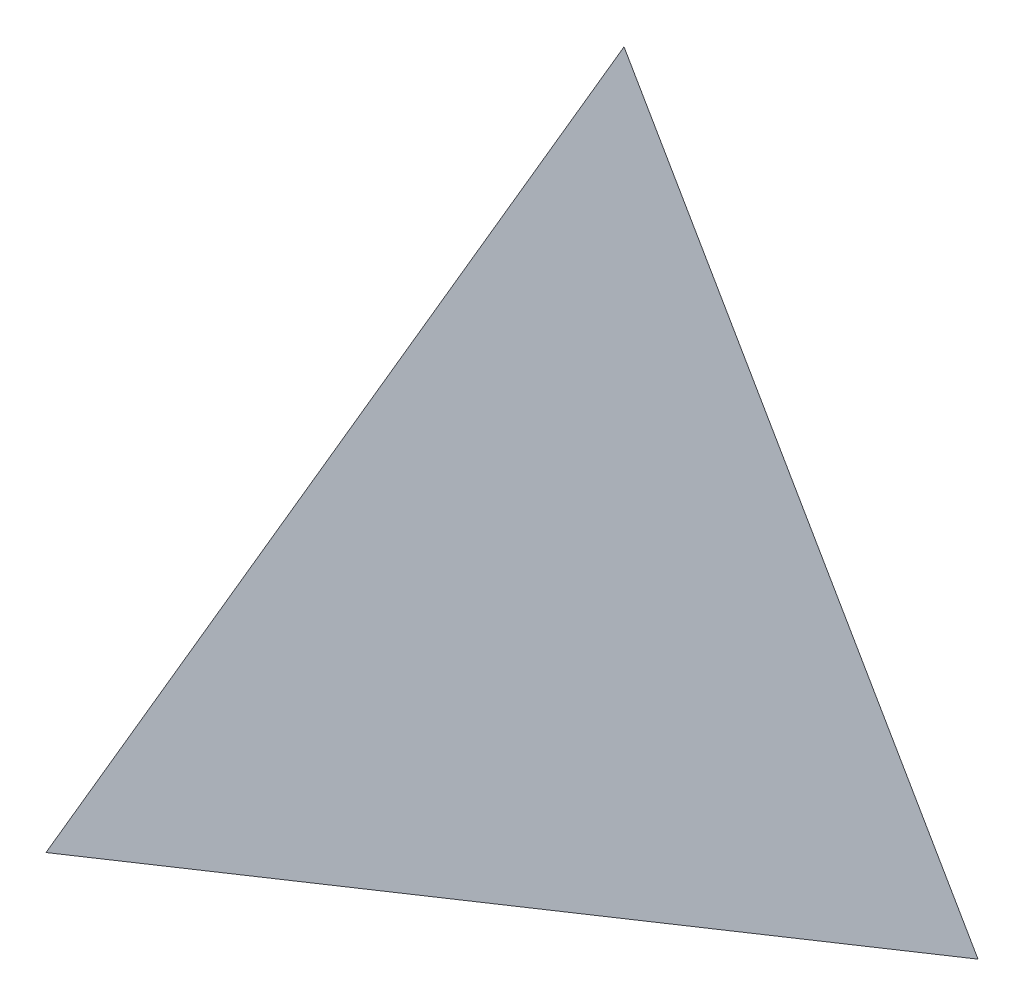
ISO-10303-21;
HEADER;
FILE_DESCRIPTION(('STEP AP214'),'2;1');
FILE_NAME('part.step','',(''),(''),'','','');
FILE_SCHEMA(('AUTOMOTIVE_DESIGN { 1 0 10303 214 1 1 1 1 }'));
ENDSEC;
DATA;
#1=APPLICATION_CONTEXT('core data for automotive mechanical design processes');
#2=APPLICATION_PROTOCOL_DEFINITION('international standard','automotive_design',2000,#1);
#3=PRODUCT_CONTEXT('',#1,'mechanical');
#4=PRODUCT('Part','Part','',(#3));
#5=PRODUCT_RELATED_PRODUCT_CATEGORY('part','',(#4));
#6=PRODUCT_DEFINITION_FORMATION('','',#4);
#7=PRODUCT_DEFINITION_CONTEXT('part definition',#1,'design');
#8=PRODUCT_DEFINITION('design','',#6,#7);
#9=PRODUCT_DEFINITION_SHAPE('','',#8);
#10=(LENGTH_UNIT() NAMED_UNIT(*) SI_UNIT(.MILLI.,.METRE.));
#11=(NAMED_UNIT(*) PLANE_ANGLE_UNIT() SI_UNIT($,.RADIAN.));
#12=(NAMED_UNIT(*) SI_UNIT($,.STERADIAN.) SOLID_ANGLE_UNIT());
#13=UNCERTAINTY_MEASURE_WITH_UNIT(LENGTH_MEASURE(1.E-05),#10,'distance_accuracy_value','');
#14=(GEOMETRIC_REPRESENTATION_CONTEXT(3) GLOBAL_UNCERTAINTY_ASSIGNED_CONTEXT((#13)) GLOBAL_UNIT_ASSIGNED_CONTEXT((#10,
#11,#12)) REPRESENTATION_CONTEXT('',''));
#15=CARTESIAN_POINT('',(0.,0.,0.));
#16=DIRECTION('',(0.,0.,1.));
#17=DIRECTION('',(1.,0.,0.));
#18=AXIS2_PLACEMENT_3D('',#15,#16,#17);
#19=CARTESIAN_POINT('',(0.,0.,-16.6666666666667));
#20=DIRECTION('',(0.,0.,-1.));
#21=DIRECTION('',(-1.,0.,0.));
#22=AXIS2_PLACEMENT_3D('',#19,#20,#21);
#23=PLANE('',#22);
#24=DIRECTION('',(0.5,0.866025403784439,0.));
#25=VECTOR('',#24,1.);
#26=CARTESIAN_POINT('',(-40.8248290463863,-23.5702260395516,-16.6666666666667));
#27=LINE('',#26,#25);
#28=CARTESIAN_POINT('',(-40.8248290463863,-23.5702260395516,-16.6666666666667));
#29=VERTEX_POINT('',#28);
#30=CARTESIAN_POINT('',(0.,47.1404520791032,-16.6666666666667));
#31=VERTEX_POINT('',#30);
#32=EDGE_CURVE('E83',#29,#31,#27,.T.);
#33=ORIENTED_EDGE('',*,*,#32,.T.);
#34=DIRECTION('',(0.5,-0.866025403784439,0.));
#35=VECTOR('',#34,1.);
#36=CARTESIAN_POINT('',(0.,47.1404520791032,-16.6666666666667));
#37=LINE('',#36,#35);
#38=CARTESIAN_POINT('',(40.8248290463863,-23.5702260395516,-16.6666666666667));
#39=VERTEX_POINT('',#38);
#40=EDGE_CURVE('E63',#31,#39,#37,.T.);
#41=ORIENTED_EDGE('',*,*,#40,.T.);
#42=DIRECTION('',(-1.,0.,0.));
#43=VECTOR('',#42,1.);
#44=CARTESIAN_POINT('',(40.8248290463863,-23.5702260395516,-16.6666666666667));
#45=LINE('',#44,#43);
#46=EDGE_CURVE('E73',#39,#29,#45,.T.);
#47=ORIENTED_EDGE('',*,*,#46,.T.);
#48=EDGE_LOOP('',(#33,#41,#47));
#49=FACE_BOUND('',#48,.T.);
#50=ADVANCED_FACE('F38',(#49),#23,.T.);
#51=CARTESIAN_POINT('',(13.6082763487954,7.85674201318386,5.55555555555555));
#52=DIRECTION('',(-0.816496580927726,-0.471404520791032,-0.333333333333333));
#53=DIRECTION('',(0.5,-0.866025403784438,0.));
#54=AXIS2_PLACEMENT_3D('',#51,#52,#53);
#55=PLANE('',#54);
#56=DIRECTION('',(0.,-0.577350269189626,0.816496580927726));
#57=VECTOR('',#56,1.);
#58=CARTESIAN_POINT('',(0.,47.1404520791032,-16.6666666666667));
#59=LINE('',#58,#57);
#60=CARTESIAN_POINT('',(0.,0.,50.));
#61=VERTEX_POINT('',#60);
#62=EDGE_CURVE('E71',#31,#61,#59,.T.);
#63=ORIENTED_EDGE('',*,*,#62,.T.);
#64=DIRECTION('',(-0.5,0.288675134594813,0.816496580927726));
#65=VECTOR('',#64,1.);
#66=CARTESIAN_POINT('',(40.8248290463863,-23.5702260395516,-16.6666666666667));
#67=LINE('',#66,#65);
#68=EDGE_CURVE('E50',#39,#61,#67,.T.);
#69=ORIENTED_EDGE('',*,*,#68,.F.);
#70=ORIENTED_EDGE('',*,*,#40,.F.);
#71=EDGE_LOOP('',(#63,#69,#70));
#72=FACE_BOUND('',#71,.T.);
#73=ADVANCED_FACE('F70',(#72),#55,.F.);
#74=CARTESIAN_POINT('',(0.,-15.7134840263677,5.55555555555556));
#75=DIRECTION('',(0.,0.942809041582063,-0.333333333333333));
#76=DIRECTION('',(0.,0.333333333333333,0.942809041582063));
#77=AXIS2_PLACEMENT_3D('',#74,#75,#76);
#78=PLANE('',#77);
#79=ORIENTED_EDGE('',*,*,#68,.T.);
#80=DIRECTION('',(0.5,0.288675134594813,0.816496580927726));
#81=VECTOR('',#80,1.);
#82=CARTESIAN_POINT('',(-40.8248290463863,-23.5702260395516,-16.6666666666667));
#83=LINE('',#82,#81);
#84=EDGE_CURVE('E12',#29,#61,#83,.T.);
#85=ORIENTED_EDGE('',*,*,#84,.F.);
#86=ORIENTED_EDGE('',*,*,#46,.F.);
#87=EDGE_LOOP('',(#79,#85,#86));
#88=FACE_BOUND('',#87,.T.);
#89=ADVANCED_FACE('F75',(#88),#78,.F.);
#90=CARTESIAN_POINT('',(-13.6082763487954,7.85674201318386,5.55555555555556));
#91=DIRECTION('',(0.816496580927726,-0.471404520791032,-0.333333333333333));
#92=DIRECTION('',(0.5,0.866025403784439,0.));
#93=AXIS2_PLACEMENT_3D('',#90,#91,#92);
#94=PLANE('',#93);
#95=ORIENTED_EDGE('',*,*,#84,.T.);
#96=ORIENTED_EDGE('',*,*,#62,.F.);
#97=ORIENTED_EDGE('',*,*,#32,.F.);
#98=EDGE_LOOP('',(#95,#96,#97));
#99=FACE_BOUND('',#98,.T.);
#100=ADVANCED_FACE('F40',(#99),#94,.F.);
#101=CLOSED_SHELL('',(#50,#73,#89,#100));
#102=MANIFOLD_SOLID_BREP('B2',#101);
#103=ADVANCED_BREP_SHAPE_REPRESENTATION('',(#18,#102),#14);
#104=SHAPE_DEFINITION_REPRESENTATION(#9,#103);
ENDSEC;
END-ISO-10303-21;
